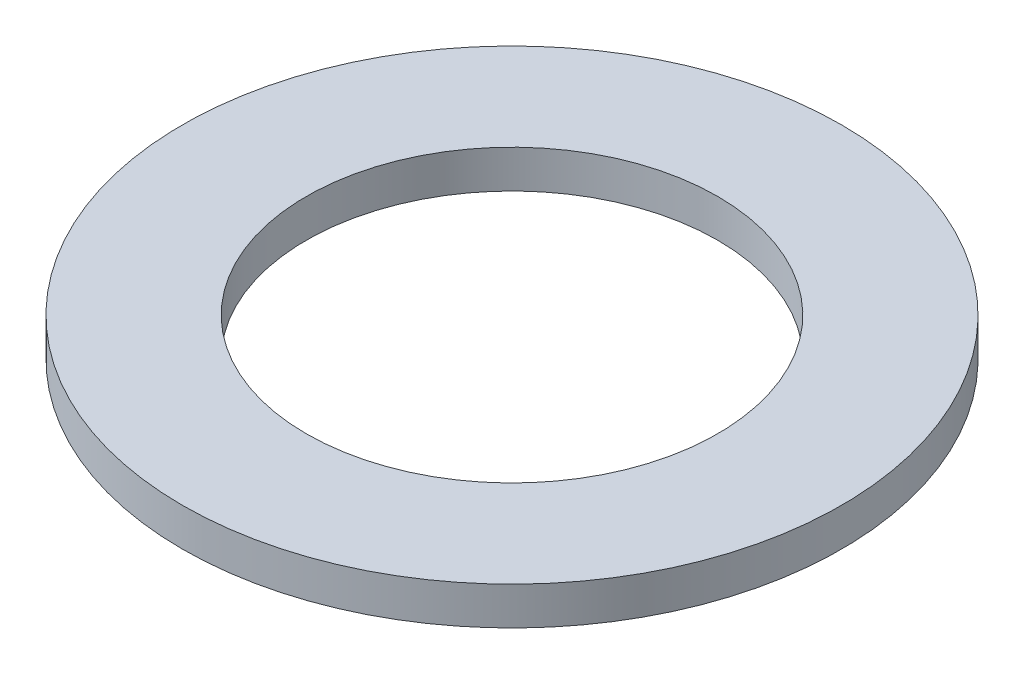
ISO-10303-21;
HEADER;
FILE_DESCRIPTION(('STEP AP214'),'2;1');
FILE_NAME('part.step','',(''),(''),'','','');
FILE_SCHEMA(('AUTOMOTIVE_DESIGN { 1 0 10303 214 1 1 1 1 }'));
ENDSEC;
DATA;
#1=APPLICATION_CONTEXT('core data for automotive mechanical design processes');
#2=APPLICATION_PROTOCOL_DEFINITION('international standard','automotive_design',2000,#1);
#3=PRODUCT_CONTEXT('',#1,'mechanical');
#4=PRODUCT('Part','Part','',(#3));
#5=PRODUCT_RELATED_PRODUCT_CATEGORY('part','',(#4));
#6=PRODUCT_DEFINITION_FORMATION('','',#4);
#7=PRODUCT_DEFINITION_CONTEXT('part definition',#1,'design');
#8=PRODUCT_DEFINITION('design','',#6,#7);
#9=PRODUCT_DEFINITION_SHAPE('','',#8);
#10=(LENGTH_UNIT() NAMED_UNIT(*) SI_UNIT(.MILLI.,.METRE.));
#11=(NAMED_UNIT(*) PLANE_ANGLE_UNIT() SI_UNIT($,.RADIAN.));
#12=(NAMED_UNIT(*) SI_UNIT($,.STERADIAN.) SOLID_ANGLE_UNIT());
#13=UNCERTAINTY_MEASURE_WITH_UNIT(LENGTH_MEASURE(1.E-05),#10,'distance_accuracy_value','');
#14=(GEOMETRIC_REPRESENTATION_CONTEXT(3) GLOBAL_UNCERTAINTY_ASSIGNED_CONTEXT((#13)) GLOBAL_UNIT_ASSIGNED_CONTEXT((#10,
#11,#12)) REPRESENTATION_CONTEXT('',''));
#15=CARTESIAN_POINT('',(0.,0.,0.));
#16=DIRECTION('',(0.,0.,1.));
#17=DIRECTION('',(1.,0.,0.));
#18=AXIS2_PLACEMENT_3D('',#15,#16,#17);
#19=CARTESIAN_POINT('',(0.,0.9144,0.));
#20=DIRECTION('',(0.,-1.,0.));
#21=DIRECTION('',(0.,0.,-1.));
#22=AXIS2_PLACEMENT_3D('',#19,#20,#21);
#23=CYLINDRICAL_SURFACE('',#22,7.9375);
#24=CARTESIAN_POINT('',(0.,0.9144,0.));
#25=DIRECTION('',(0.,1.,0.));
#26=DIRECTION('',(0.,0.,1.));
#27=AXIS2_PLACEMENT_3D('',#24,#25,#26);
#28=CIRCLE('',#27,7.9375);
#29=CARTESIAN_POINT('',(0.,0.9144,7.9375));
#30=VERTEX_POINT('',#29);
#31=EDGE_CURVE('E10',#30,#30,#28,.T.);
#32=ORIENTED_EDGE('',*,*,#31,.F.);
#33=EDGE_LOOP('',(#32));
#34=FACE_BOUND('',#33,.T.);
#35=CARTESIAN_POINT('',(0.,0.,0.));
#36=DIRECTION('',(0.,1.,0.));
#37=DIRECTION('',(0.,0.,1.));
#38=AXIS2_PLACEMENT_3D('',#35,#36,#37);
#39=CIRCLE('',#38,7.9375);
#40=CARTESIAN_POINT('',(0.,0.,7.9375));
#41=VERTEX_POINT('',#40);
#42=EDGE_CURVE('E35',#41,#41,#39,.T.);
#43=ORIENTED_EDGE('',*,*,#42,.T.);
#44=EDGE_LOOP('',(#43));
#45=FACE_BOUND('',#44,.T.);
#46=ADVANCED_FACE('F32',(#34,#45),#23,.T.);
#47=CARTESIAN_POINT('',(0.,0.9144,0.));
#48=DIRECTION('',(0.,1.,0.));
#49=DIRECTION('',(0.,0.,1.));
#50=AXIS2_PLACEMENT_3D('',#47,#48,#49);
#51=PLANE('',#50);
#52=CARTESIAN_POINT('',(0.,0.9144,0.));
#53=DIRECTION('',(0.,1.,0.));
#54=DIRECTION('',(0.,0.,1.));
#55=AXIS2_PLACEMENT_3D('',#52,#53,#54);
#56=CIRCLE('',#55,4.953);
#57=CARTESIAN_POINT('',(0.,0.9144,4.953));
#58=VERTEX_POINT('',#57);
#59=EDGE_CURVE('E44',#58,#58,#56,.T.);
#60=ORIENTED_EDGE('',*,*,#59,.F.);
#61=EDGE_LOOP('',(#60));
#62=FACE_BOUND('',#61,.T.);
#63=ORIENTED_EDGE('',*,*,#31,.T.);
#64=EDGE_LOOP('',(#63));
#65=FACE_BOUND('',#64,.T.);
#66=ADVANCED_FACE('F59',(#62,#65),#51,.T.);
#67=CARTESIAN_POINT('',(0.,0.,0.));
#68=DIRECTION('',(0.,1.,0.));
#69=DIRECTION('',(0.,0.,1.));
#70=AXIS2_PLACEMENT_3D('',#67,#68,#69);
#71=PLANE('',#70);
#72=CARTESIAN_POINT('',(0.,0.,0.));
#73=DIRECTION('',(0.,1.,0.));
#74=DIRECTION('',(0.,0.,1.));
#75=AXIS2_PLACEMENT_3D('',#72,#73,#74);
#76=CIRCLE('',#75,4.953);
#77=CARTESIAN_POINT('',(0.,0.,4.953));
#78=VERTEX_POINT('',#77);
#79=EDGE_CURVE('E42',#78,#78,#76,.T.);
#80=ORIENTED_EDGE('',*,*,#79,.T.);
#81=EDGE_LOOP('',(#80));
#82=FACE_BOUND('',#81,.T.);
#83=ORIENTED_EDGE('',*,*,#42,.F.);
#84=EDGE_LOOP('',(#83));
#85=FACE_BOUND('',#84,.T.);
#86=ADVANCED_FACE('F50',(#82,#85),#71,.F.);
#87=CARTESIAN_POINT('',(0.,0.,0.));
#88=DIRECTION('',(0.,1.,0.));
#89=DIRECTION('',(0.,0.,1.));
#90=AXIS2_PLACEMENT_3D('',#87,#88,#89);
#91=CYLINDRICAL_SURFACE('',#90,4.953);
#92=ORIENTED_EDGE('',*,*,#79,.F.);
#93=EDGE_LOOP('',(#92));
#94=FACE_BOUND('',#93,.T.);
#95=ORIENTED_EDGE('',*,*,#59,.T.);
#96=EDGE_LOOP('',(#95));
#97=FACE_BOUND('',#96,.T.);
#98=ADVANCED_FACE('F53',(#94,#97),#91,.F.);
#99=CLOSED_SHELL('',(#46,#66,#86,#98));
#100=MANIFOLD_SOLID_BREP('B2',#99);
#101=ADVANCED_BREP_SHAPE_REPRESENTATION('',(#18,#100),#14);
#102=SHAPE_DEFINITION_REPRESENTATION(#9,#101);
ENDSEC;
END-ISO-10303-21;
